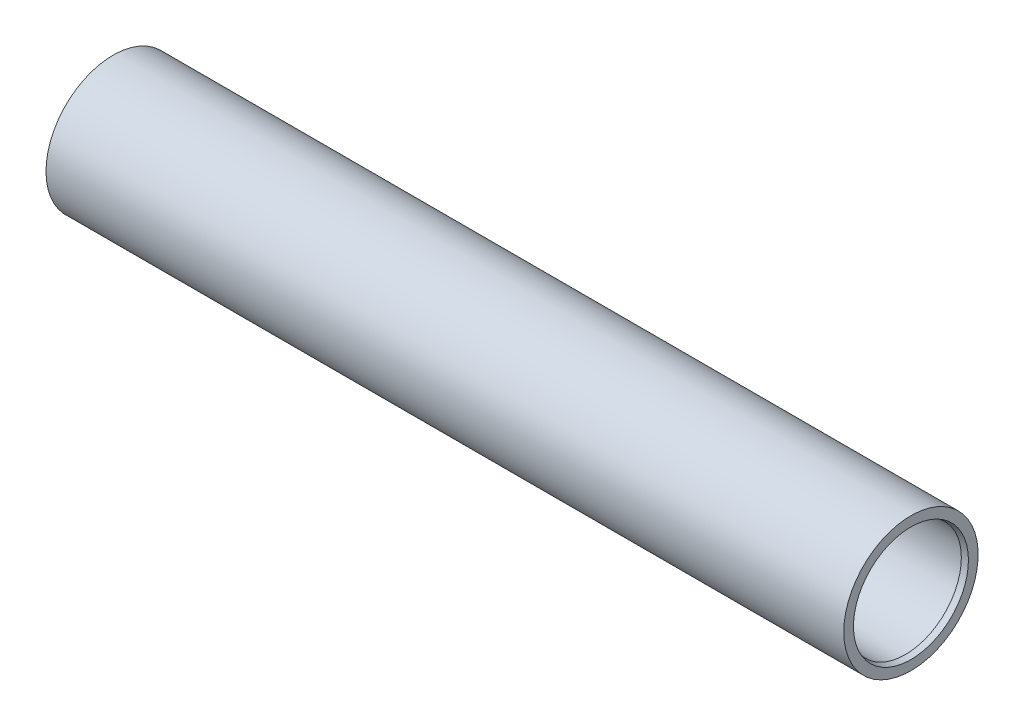
ISO-10303-21;
HEADER;
FILE_DESCRIPTION(('STEP AP214'),'2;1');
FILE_NAME('part.step','',(''),(''),'','','');
FILE_SCHEMA(('AUTOMOTIVE_DESIGN { 1 0 10303 214 1 1 1 1 }'));
ENDSEC;
DATA;
#1=APPLICATION_CONTEXT('core data for automotive mechanical design processes');
#2=APPLICATION_PROTOCOL_DEFINITION('international standard','automotive_design',2000,#1);
#3=PRODUCT_CONTEXT('',#1,'mechanical');
#4=PRODUCT('Part','Part','',(#3));
#5=PRODUCT_RELATED_PRODUCT_CATEGORY('part','',(#4));
#6=PRODUCT_DEFINITION_FORMATION('','',#4);
#7=PRODUCT_DEFINITION_CONTEXT('part definition',#1,'design');
#8=PRODUCT_DEFINITION('design','',#6,#7);
#9=PRODUCT_DEFINITION_SHAPE('','',#8);
#10=(LENGTH_UNIT() NAMED_UNIT(*) SI_UNIT(.MILLI.,.METRE.));
#11=(NAMED_UNIT(*) PLANE_ANGLE_UNIT() SI_UNIT($,.RADIAN.));
#12=(NAMED_UNIT(*) SI_UNIT($,.STERADIAN.) SOLID_ANGLE_UNIT());
#13=UNCERTAINTY_MEASURE_WITH_UNIT(LENGTH_MEASURE(1.E-05),#10,'distance_accuracy_value','');
#14=(GEOMETRIC_REPRESENTATION_CONTEXT(3) GLOBAL_UNCERTAINTY_ASSIGNED_CONTEXT((#13)) GLOBAL_UNIT_ASSIGNED_CONTEXT((#10,
#11,#12)) REPRESENTATION_CONTEXT('',''));
#15=CARTESIAN_POINT('',(0.,0.,0.));
#16=DIRECTION('',(0.,0.,1.));
#17=DIRECTION('',(1.,0.,0.));
#18=AXIS2_PLACEMENT_3D('',#15,#16,#17);
#19=CARTESIAN_POINT('',(-105.,0.,0.));
#20=DIRECTION('',(-1.,0.,0.));
#21=DIRECTION('',(0.,0.,1.));
#22=AXIS2_PLACEMENT_3D('',#19,#20,#21);
#23=CYLINDRICAL_SURFACE('',#22,24.);
#24=CARTESIAN_POINT('',(193.,0.,0.));
#25=DIRECTION('',(-1.,0.,0.));
#26=DIRECTION('',(0.,0.,1.));
#27=AXIS2_PLACEMENT_3D('',#24,#25,#26);
#28=CIRCLE('',#27,24.);
#29=CARTESIAN_POINT('',(193.,0.,24.));
#30=VERTEX_POINT('',#29);
#31=EDGE_CURVE('E52',#30,#30,#28,.T.);
#32=ORIENTED_EDGE('',*,*,#31,.T.);
#33=EDGE_LOOP('',(#32));
#34=FACE_BOUND('',#33,.T.);
#35=CARTESIAN_POINT('',(-92.,0.,0.));
#36=DIRECTION('',(-1.,0.,0.));
#37=DIRECTION('',(0.,0.,1.));
#38=AXIS2_PLACEMENT_3D('',#35,#36,#37);
#39=CIRCLE('',#38,24.);
#40=CARTESIAN_POINT('',(-92.,0.,24.));
#41=VERTEX_POINT('',#40);
#42=EDGE_CURVE('E55',#41,#41,#39,.T.);
#43=ORIENTED_EDGE('',*,*,#42,.F.);
#44=EDGE_LOOP('',(#43));
#45=FACE_BOUND('',#44,.T.);
#46=ADVANCED_FACE('F33',(#34,#45),#23,.T.);
#47=CARTESIAN_POINT('',(193.,24.,0.));
#48=DIRECTION('',(1.,0.,0.));
#49=DIRECTION('',(0.,0.,-1.));
#50=AXIS2_PLACEMENT_3D('',#47,#48,#49);
#51=PLANE('',#50);
#52=CARTESIAN_POINT('',(193.,0.,0.));
#53=DIRECTION('',(1.,0.,0.));
#54=DIRECTION('',(0.,0.,-1.));
#55=AXIS2_PLACEMENT_3D('',#52,#53,#54);
#56=CIRCLE('',#55,20.5358983848623);
#57=CARTESIAN_POINT('',(193.,0.,-20.5358983848623));
#58=VERTEX_POINT('',#57);
#59=EDGE_CURVE('E47',#58,#58,#56,.F.);
#60=ORIENTED_EDGE('',*,*,#59,.T.);
#61=EDGE_LOOP('',(#60));
#62=FACE_BOUND('',#61,.T.);
#63=ORIENTED_EDGE('',*,*,#31,.F.);
#64=EDGE_LOOP('',(#63));
#65=FACE_BOUND('',#64,.T.);
#66=ADVANCED_FACE('F62',(#62,#65),#51,.T.);
#67=CARTESIAN_POINT('',(-105.,0.,0.));
#68=DIRECTION('',(-1.,0.,0.));
#69=DIRECTION('',(0.,0.,1.));
#70=AXIS2_PLACEMENT_3D('',#67,#68,#69);
#71=CYLINDRICAL_SURFACE('',#70,20.);
#72=CARTESIAN_POINT('',(-91.4641016151378,0.,0.));
#73=DIRECTION('',(-1.,0.,0.));
#74=DIRECTION('',(0.,0.,1.));
#75=AXIS2_PLACEMENT_3D('',#72,#73,#74);
#76=CIRCLE('',#75,20.);
#77=CARTESIAN_POINT('',(-91.4641016151378,0.,20.));
#78=VERTEX_POINT('',#77);
#79=EDGE_CURVE('E39',#78,#78,#76,.T.);
#80=ORIENTED_EDGE('',*,*,#79,.T.);
#81=EDGE_LOOP('',(#80));
#82=FACE_BOUND('',#81,.T.);
#83=CARTESIAN_POINT('',(191.,0.,0.));
#84=DIRECTION('',(1.,0.,0.));
#85=DIRECTION('',(0.,0.,-1.));
#86=AXIS2_PLACEMENT_3D('',#83,#84,#85);
#87=CIRCLE('',#86,20.);
#88=CARTESIAN_POINT('',(191.,0.,-20.));
#89=VERTEX_POINT('',#88);
#90=EDGE_CURVE('E43',#89,#89,#87,.T.);
#91=ORIENTED_EDGE('',*,*,#90,.T.);
#92=EDGE_LOOP('',(#91));
#93=FACE_BOUND('',#92,.T.);
#94=ADVANCED_FACE('F67',(#82,#93),#71,.F.);
#95=CARTESIAN_POINT('',(-92.,20.,0.));
#96=DIRECTION('',(-1.,0.,0.));
#97=DIRECTION('',(0.,0.,1.));
#98=AXIS2_PLACEMENT_3D('',#95,#96,#97);
#99=PLANE('',#98);
#100=CARTESIAN_POINT('',(-92.,0.,0.));
#101=DIRECTION('',(-1.,0.,0.));
#102=DIRECTION('',(0.,0.,1.));
#103=AXIS2_PLACEMENT_3D('',#100,#101,#102);
#104=CIRCLE('',#103,22.);
#105=CARTESIAN_POINT('',(-92.,0.,22.));
#106=VERTEX_POINT('',#105);
#107=EDGE_CURVE('E10',#106,#106,#104,.F.);
#108=ORIENTED_EDGE('',*,*,#107,.T.);
#109=EDGE_LOOP('',(#108));
#110=FACE_BOUND('',#109,.T.);
#111=ORIENTED_EDGE('',*,*,#42,.T.);
#112=EDGE_LOOP('',(#111));
#113=FACE_BOUND('',#112,.T.);
#114=ADVANCED_FACE('F59',(#110,#113),#99,.T.);
#115=CARTESIAN_POINT('',(193.,0.,0.));
#116=DIRECTION('',(1.,0.,0.));
#117=DIRECTION('',(0.,0.,-1.));
#118=AXIS2_PLACEMENT_3D('',#115,#116,#117);
#119=CONICAL_SURFACE('',#118,20.5358983848623,0.261799387799156);
#120=ORIENTED_EDGE('',*,*,#90,.F.);
#121=EDGE_LOOP('',(#120));
#122=FACE_BOUND('',#121,.T.);
#123=ORIENTED_EDGE('',*,*,#59,.F.);
#124=EDGE_LOOP('',(#123));
#125=FACE_BOUND('',#124,.T.);
#126=ADVANCED_FACE('F78',(#122,#125),#119,.F.);
#127=CARTESIAN_POINT('',(-91.4641016151378,0.,0.));
#128=DIRECTION('',(-1.,0.,0.));
#129=DIRECTION('',(0.,0.,1.));
#130=AXIS2_PLACEMENT_3D('',#127,#128,#129);
#131=CONICAL_SURFACE('',#130,20.,1.30899693899574);
#132=ORIENTED_EDGE('',*,*,#107,.F.);
#133=EDGE_LOOP('',(#132));
#134=FACE_BOUND('',#133,.T.);
#135=ORIENTED_EDGE('',*,*,#79,.F.);
#136=EDGE_LOOP('',(#135));
#137=FACE_BOUND('',#136,.T.);
#138=ADVANCED_FACE('F81',(#134,#137),#131,.F.);
#139=CLOSED_SHELL('',(#46,#66,#94,#114,#126,#138));
#140=MANIFOLD_SOLID_BREP('B2',#139);
#141=ADVANCED_BREP_SHAPE_REPRESENTATION('',(#18,#140),#14);
#142=SHAPE_DEFINITION_REPRESENTATION(#9,#141);
ENDSEC;
END-ISO-10303-21;
